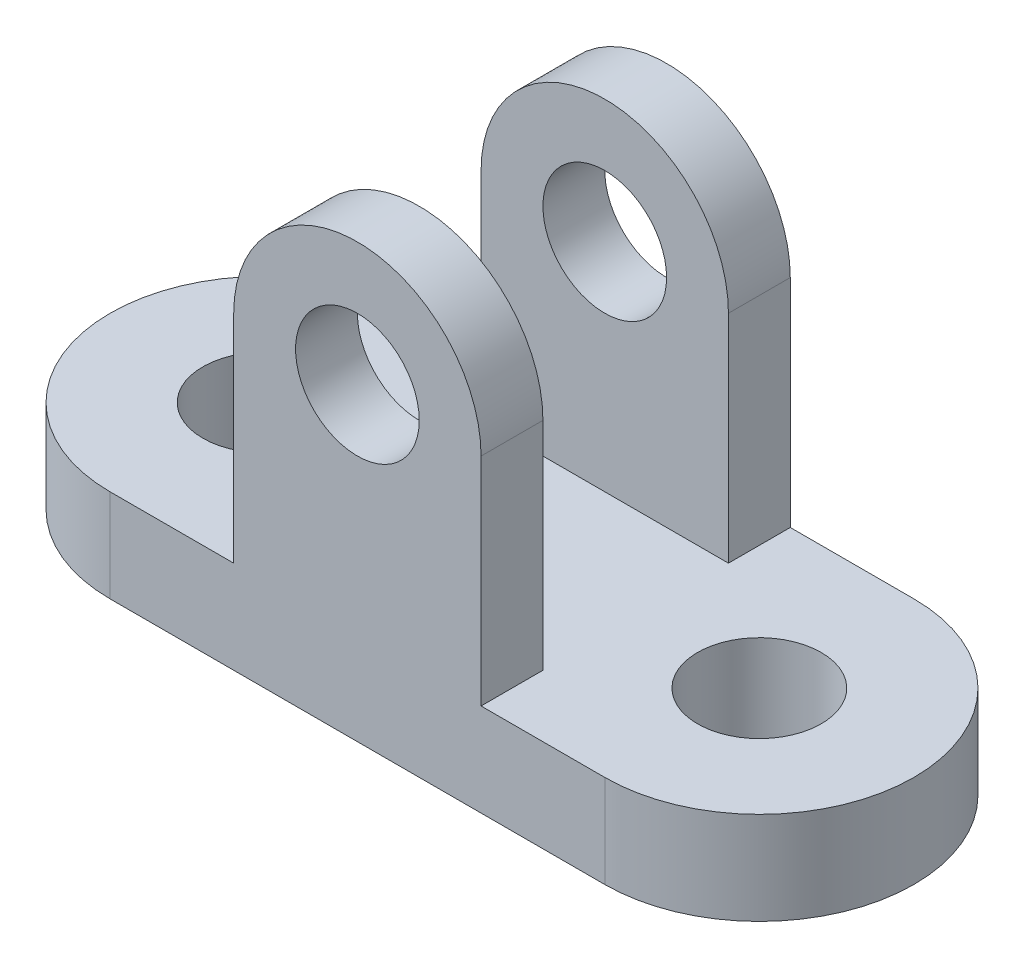
ISO-10303-21;
HEADER;
FILE_DESCRIPTION(('STEP AP214'),'2;1');
FILE_NAME('part.step','',(''),(''),'','','');
FILE_SCHEMA(('AUTOMOTIVE_DESIGN { 1 0 10303 214 1 1 1 1 }'));
ENDSEC;
DATA;
#1=APPLICATION_CONTEXT('core data for automotive mechanical design processes');
#2=APPLICATION_PROTOCOL_DEFINITION('international standard','automotive_design',2000,#1);
#3=PRODUCT_CONTEXT('',#1,'mechanical');
#4=PRODUCT('Part','Part','',(#3));
#5=PRODUCT_RELATED_PRODUCT_CATEGORY('part','',(#4));
#6=PRODUCT_DEFINITION_FORMATION('','',#4);
#7=PRODUCT_DEFINITION_CONTEXT('part definition',#1,'design');
#8=PRODUCT_DEFINITION('design','',#6,#7);
#9=PRODUCT_DEFINITION_SHAPE('','',#8);
#10=(LENGTH_UNIT() NAMED_UNIT(*) SI_UNIT(.MILLI.,.METRE.));
#11=(NAMED_UNIT(*) PLANE_ANGLE_UNIT() SI_UNIT($,.RADIAN.));
#12=(NAMED_UNIT(*) SI_UNIT($,.STERADIAN.) SOLID_ANGLE_UNIT());
#13=UNCERTAINTY_MEASURE_WITH_UNIT(LENGTH_MEASURE(1.E-05),#10,'distance_accuracy_value','');
#14=(GEOMETRIC_REPRESENTATION_CONTEXT(3) GLOBAL_UNCERTAINTY_ASSIGNED_CONTEXT((#13)) GLOBAL_UNIT_ASSIGNED_CONTEXT((#10,
#11,#12)) REPRESENTATION_CONTEXT('',''));
#15=CARTESIAN_POINT('',(0.,0.,0.));
#16=DIRECTION('',(0.,0.,1.));
#17=DIRECTION('',(1.,0.,0.));
#18=AXIS2_PLACEMENT_3D('',#15,#16,#17);
#19=CARTESIAN_POINT('',(-20.,0.,-105.622577482986));
#20=DIRECTION('',(-1.,0.,0.));
#21=DIRECTION('',(0.,0.,1.));
#22=AXIS2_PLACEMENT_3D('',#19,#20,#21);
#23=PLANE('',#22);
#24=DIRECTION('',(0.,0.,1.));
#25=VECTOR('',#24,1.);
#26=CARTESIAN_POINT('',(-20.,15.,0.));
#27=LINE('',#26,#25);
#28=CARTESIAN_POINT('',(-20.,15.,-25.));
#29=VERTEX_POINT('',#28);
#30=CARTESIAN_POINT('',(-20.,15.,-15.));
#31=VERTEX_POINT('',#30);
#32=EDGE_CURVE('E162',#29,#31,#27,.T.);
#33=ORIENTED_EDGE('',*,*,#32,.T.);
#34=DIRECTION('',(0.,1.,0.));
#35=VECTOR('',#34,1.);
#36=CARTESIAN_POINT('',(-20.,0.,-15.));
#37=LINE('',#36,#35);
#38=CARTESIAN_POINT('',(-20.,50.,-15.));
#39=VERTEX_POINT('',#38);
#40=EDGE_CURVE('E240',#31,#39,#37,.T.);
#41=ORIENTED_EDGE('',*,*,#40,.T.);
#42=DIRECTION('',(0.,0.,1.));
#43=VECTOR('',#42,1.);
#44=CARTESIAN_POINT('',(-20.,50.,-105.622577482986));
#45=LINE('',#44,#43);
#46=CARTESIAN_POINT('',(-20.,50.,-25.));
#47=VERTEX_POINT('',#46);
#48=EDGE_CURVE('E265',#47,#39,#45,.T.);
#49=ORIENTED_EDGE('',*,*,#48,.F.);
#50=DIRECTION('',(0.,1.,0.));
#51=VECTOR('',#50,1.);
#52=CARTESIAN_POINT('',(-20.,0.,-25.));
#53=LINE('',#52,#51);
#54=EDGE_CURVE('E248',#29,#47,#53,.T.);
#55=ORIENTED_EDGE('',*,*,#54,.F.);
#56=EDGE_LOOP('',(#33,#41,#49,#55));
#57=FACE_BOUND('',#56,.T.);
#58=ADVANCED_FACE('F45',(#57),#23,.T.);
#59=CARTESIAN_POINT('',(-20.,50.,15.));
#60=VERTEX_POINT('',#59);
#61=CARTESIAN_POINT('',(-20.,50.,25.));
#62=VERTEX_POINT('',#61);
#63=EDGE_CURVE('E151',#60,#62,#45,.T.);
#64=ORIENTED_EDGE('',*,*,#63,.F.);
#65=DIRECTION('',(0.,-1.,0.));
#66=VECTOR('',#65,1.);
#67=CARTESIAN_POINT('',(-20.,0.,15.));
#68=LINE('',#67,#66);
#69=CARTESIAN_POINT('',(-20.,15.,15.));
#70=VERTEX_POINT('',#69);
#71=EDGE_CURVE('E137',#60,#70,#68,.T.);
#72=ORIENTED_EDGE('',*,*,#71,.T.);
#73=CARTESIAN_POINT('',(-20.,15.,25.));
#74=VERTEX_POINT('',#73);
#75=EDGE_CURVE('E149',#70,#74,#27,.T.);
#76=ORIENTED_EDGE('',*,*,#75,.T.);
#77=DIRECTION('',(0.,-1.,0.));
#78=VECTOR('',#77,1.);
#79=CARTESIAN_POINT('',(-20.,0.,25.));
#80=LINE('',#79,#78);
#81=EDGE_CURVE('E249',#62,#74,#80,.T.);
#82=ORIENTED_EDGE('',*,*,#81,.F.);
#83=EDGE_LOOP('',(#64,#72,#76,#82));
#84=FACE_BOUND('',#83,.T.);
#85=ADVANCED_FACE('F147',(#84),#23,.T.);
#86=CARTESIAN_POINT('',(0.,50.,-105.622577482986));
#87=DIRECTION('',(0.,0.,1.));
#88=DIRECTION('',(1.,0.,0.));
#89=AXIS2_PLACEMENT_3D('',#86,#87,#88);
#90=CYLINDRICAL_SURFACE('',#89,20.);
#91=CARTESIAN_POINT('',(0.,50.,-15.));
#92=DIRECTION('',(0.,0.,1.));
#93=DIRECTION('',(1.,0.,0.));
#94=AXIS2_PLACEMENT_3D('',#91,#92,#93);
#95=CIRCLE('',#94,20.);
#96=CARTESIAN_POINT('',(20.,50.,-15.));
#97=VERTEX_POINT('',#96);
#98=EDGE_CURVE('E237',#39,#97,#95,.F.);
#99=ORIENTED_EDGE('',*,*,#98,.T.);
#100=DIRECTION('',(0.,0.,1.));
#101=VECTOR('',#100,1.);
#102=CARTESIAN_POINT('',(20.,50.,-105.622577482986));
#103=LINE('',#102,#101);
#104=CARTESIAN_POINT('',(20.,50.,-25.));
#105=VERTEX_POINT('',#104);
#106=EDGE_CURVE('E255',#105,#97,#103,.T.);
#107=ORIENTED_EDGE('',*,*,#106,.F.);
#108=CARTESIAN_POINT('',(0.,50.,-25.));
#109=DIRECTION('',(0.,0.,1.));
#110=DIRECTION('',(1.,0.,0.));
#111=AXIS2_PLACEMENT_3D('',#108,#109,#110);
#112=CIRCLE('',#111,20.);
#113=EDGE_CURVE('E276',#47,#105,#112,.F.);
#114=ORIENTED_EDGE('',*,*,#113,.F.);
#115=ORIENTED_EDGE('',*,*,#48,.T.);
#116=EDGE_LOOP('',(#99,#107,#114,#115));
#117=FACE_BOUND('',#116,.T.);
#118=ADVANCED_FACE('F324',(#117),#90,.T.);
#119=CARTESIAN_POINT('',(20.,50.,15.));
#120=VERTEX_POINT('',#119);
#121=CARTESIAN_POINT('',(20.,50.,25.));
#122=VERTEX_POINT('',#121);
#123=EDGE_CURVE('E273',#120,#122,#103,.T.);
#124=ORIENTED_EDGE('',*,*,#123,.F.);
#125=CARTESIAN_POINT('',(0.,50.,15.));
#126=DIRECTION('',(0.,0.,-1.));
#127=DIRECTION('',(-1.,0.,0.));
#128=AXIS2_PLACEMENT_3D('',#125,#126,#127);
#129=CIRCLE('',#128,20.);
#130=EDGE_CURVE('E153',#120,#60,#129,.F.);
#131=ORIENTED_EDGE('',*,*,#130,.T.);
#132=ORIENTED_EDGE('',*,*,#63,.T.);
#133=CARTESIAN_POINT('',(0.,50.,25.));
#134=DIRECTION('',(0.,0.,1.));
#135=DIRECTION('',(1.,0.,0.));
#136=AXIS2_PLACEMENT_3D('',#133,#134,#135);
#137=CIRCLE('',#136,20.);
#138=EDGE_CURVE('E244',#122,#62,#137,.T.);
#139=ORIENTED_EDGE('',*,*,#138,.F.);
#140=EDGE_LOOP('',(#124,#131,#132,#139));
#141=FACE_BOUND('',#140,.T.);
#142=ADVANCED_FACE('F294',(#141),#90,.T.);
#143=CARTESIAN_POINT('',(20.,0.,-105.622577482986));
#144=DIRECTION('',(-1.,0.,0.));
#145=DIRECTION('',(0.,0.,1.));
#146=AXIS2_PLACEMENT_3D('',#143,#144,#145);
#147=PLANE('',#146);
#148=DIRECTION('',(0.,1.,0.));
#149=VECTOR('',#148,1.);
#150=CARTESIAN_POINT('',(20.,0.,-15.));
#151=LINE('',#150,#149);
#152=CARTESIAN_POINT('',(20.,15.,-15.));
#153=VERTEX_POINT('',#152);
#154=EDGE_CURVE('E233',#153,#97,#151,.T.);
#155=ORIENTED_EDGE('',*,*,#154,.F.);
#156=DIRECTION('',(0.,0.,1.));
#157=VECTOR('',#156,1.);
#158=CARTESIAN_POINT('',(20.,15.,0.));
#159=LINE('',#158,#157);
#160=CARTESIAN_POINT('',(20.,15.,-25.));
#161=VERTEX_POINT('',#160);
#162=EDGE_CURVE('E163',#161,#153,#159,.T.);
#163=ORIENTED_EDGE('',*,*,#162,.F.);
#164=DIRECTION('',(0.,1.,0.));
#165=VECTOR('',#164,1.);
#166=CARTESIAN_POINT('',(20.,0.,-25.));
#167=LINE('',#166,#165);
#168=EDGE_CURVE('E269',#161,#105,#167,.T.);
#169=ORIENTED_EDGE('',*,*,#168,.T.);
#170=ORIENTED_EDGE('',*,*,#106,.T.);
#171=EDGE_LOOP('',(#155,#163,#169,#170));
#172=FACE_BOUND('',#171,.T.);
#173=ADVANCED_FACE('F316',(#172),#147,.F.);
#174=DIRECTION('',(0.,-1.,0.));
#175=VECTOR('',#174,1.);
#176=CARTESIAN_POINT('',(20.,0.,15.));
#177=LINE('',#176,#175);
#178=CARTESIAN_POINT('',(20.,15.,15.));
#179=VERTEX_POINT('',#178);
#180=EDGE_CURVE('E140',#120,#179,#177,.T.);
#181=ORIENTED_EDGE('',*,*,#180,.F.);
#182=ORIENTED_EDGE('',*,*,#123,.T.);
#183=DIRECTION('',(0.,-1.,0.));
#184=VECTOR('',#183,1.);
#185=CARTESIAN_POINT('',(20.,0.,25.));
#186=LINE('',#185,#184);
#187=CARTESIAN_POINT('',(20.,15.,25.));
#188=VERTEX_POINT('',#187);
#189=EDGE_CURVE('E250',#122,#188,#186,.T.);
#190=ORIENTED_EDGE('',*,*,#189,.T.);
#191=EDGE_CURVE('E68',#179,#188,#159,.T.);
#192=ORIENTED_EDGE('',*,*,#191,.F.);
#193=EDGE_LOOP('',(#181,#182,#190,#192));
#194=FACE_BOUND('',#193,.T.);
#195=ADVANCED_FACE('F287',(#194),#147,.F.);
#196=CARTESIAN_POINT('',(0.,50.,-105.622577482986));
#197=DIRECTION('',(0.,0.,1.));
#198=DIRECTION('',(1.,0.,0.));
#199=AXIS2_PLACEMENT_3D('',#196,#197,#198);
#200=CYLINDRICAL_SURFACE('',#199,10.);
#201=CARTESIAN_POINT('',(0.,50.,-25.));
#202=DIRECTION('',(0.,0.,1.));
#203=DIRECTION('',(1.,0.,0.));
#204=AXIS2_PLACEMENT_3D('',#201,#202,#203);
#205=CIRCLE('',#204,10.);
#206=CARTESIAN_POINT('',(10.,50.,-25.));
#207=VERTEX_POINT('',#206);
#208=EDGE_CURVE('E254',#207,#207,#205,.F.);
#209=ORIENTED_EDGE('',*,*,#208,.T.);
#210=EDGE_LOOP('',(#209));
#211=FACE_BOUND('',#210,.T.);
#212=CARTESIAN_POINT('',(0.,50.,-15.));
#213=DIRECTION('',(0.,0.,1.));
#214=DIRECTION('',(1.,0.,0.));
#215=AXIS2_PLACEMENT_3D('',#212,#213,#214);
#216=CIRCLE('',#215,10.);
#217=CARTESIAN_POINT('',(10.,50.,-15.));
#218=VERTEX_POINT('',#217);
#219=EDGE_CURVE('E49',#218,#218,#216,.F.);
#220=ORIENTED_EDGE('',*,*,#219,.F.);
#221=EDGE_LOOP('',(#220));
#222=FACE_BOUND('',#221,.T.);
#223=ADVANCED_FACE('F377',(#211,#222),#200,.F.);
#224=CARTESIAN_POINT('',(0.,50.,25.));
#225=DIRECTION('',(0.,0.,1.));
#226=DIRECTION('',(1.,0.,0.));
#227=AXIS2_PLACEMENT_3D('',#224,#225,#226);
#228=CIRCLE('',#227,10.);
#229=CARTESIAN_POINT('',(10.,50.,25.));
#230=VERTEX_POINT('',#229);
#231=EDGE_CURVE('E258',#230,#230,#228,.T.);
#232=ORIENTED_EDGE('',*,*,#231,.T.);
#233=EDGE_LOOP('',(#232));
#234=FACE_BOUND('',#233,.T.);
#235=CARTESIAN_POINT('',(0.,50.,15.));
#236=DIRECTION('',(0.,0.,-1.));
#237=DIRECTION('',(-1.,0.,0.));
#238=AXIS2_PLACEMENT_3D('',#235,#236,#237);
#239=CIRCLE('',#238,10.);
#240=CARTESIAN_POINT('',(-10.,50.,15.));
#241=VERTEX_POINT('',#240);
#242=EDGE_CURVE('E142',#241,#241,#239,.F.);
#243=ORIENTED_EDGE('',*,*,#242,.F.);
#244=EDGE_LOOP('',(#243));
#245=FACE_BOUND('',#244,.T.);
#246=ADVANCED_FACE('F348',(#234,#245),#200,.F.);
#247=CARTESIAN_POINT('',(-40.,15.,0.));
#248=DIRECTION('',(0.,1.,0.));
#249=DIRECTION('',(0.,0.,1.));
#250=AXIS2_PLACEMENT_3D('',#247,#248,#249);
#251=PLANE('',#250);
#252=DIRECTION('',(-1.,0.,0.));
#253=VECTOR('',#252,1.);
#254=CARTESIAN_POINT('',(-29.0396991118522,15.,-15.));
#255=LINE('',#254,#253);
#256=EDGE_CURVE('E143',#153,#31,#255,.T.);
#257=ORIENTED_EDGE('',*,*,#256,.T.);
#258=ORIENTED_EDGE('',*,*,#32,.F.);
#259=DIRECTION('',(-1.,0.,0.));
#260=VECTOR('',#259,1.);
#261=CARTESIAN_POINT('',(-40.,15.,-25.));
#262=LINE('',#261,#260);
#263=CARTESIAN_POINT('',(-40.,15.,-25.));
#264=VERTEX_POINT('',#263);
#265=EDGE_CURVE('E199',#29,#264,#262,.T.);
#266=ORIENTED_EDGE('',*,*,#265,.T.);
#267=CARTESIAN_POINT('',(-40.,15.,0.));
#268=DIRECTION('',(0.,1.,0.));
#269=DIRECTION('',(0.,0.,1.));
#270=AXIS2_PLACEMENT_3D('',#267,#268,#269);
#271=CIRCLE('',#270,25.);
#272=CARTESIAN_POINT('',(-40.,15.,25.));
#273=VERTEX_POINT('',#272);
#274=EDGE_CURVE('E189',#264,#273,#271,.T.);
#275=ORIENTED_EDGE('',*,*,#274,.T.);
#276=DIRECTION('',(1.,0.,0.));
#277=VECTOR('',#276,1.);
#278=CARTESIAN_POINT('',(-40.,15.,25.));
#279=LINE('',#278,#277);
#280=EDGE_CURVE('E159',#273,#74,#279,.T.);
#281=ORIENTED_EDGE('',*,*,#280,.T.);
#282=ORIENTED_EDGE('',*,*,#75,.F.);
#283=DIRECTION('',(1.,0.,0.));
#284=VECTOR('',#283,1.);
#285=CARTESIAN_POINT('',(-29.0396991118522,15.,15.));
#286=LINE('',#285,#284);
#287=EDGE_CURVE('E63',#70,#179,#286,.T.);
#288=ORIENTED_EDGE('',*,*,#287,.T.);
#289=ORIENTED_EDGE('',*,*,#191,.T.);
#290=CARTESIAN_POINT('',(40.,15.,25.));
#291=VERTEX_POINT('',#290);
#292=EDGE_CURVE('E192',#188,#291,#279,.T.);
#293=ORIENTED_EDGE('',*,*,#292,.T.);
#294=CARTESIAN_POINT('',(40.,15.,0.));
#295=DIRECTION('',(0.,1.,0.));
#296=DIRECTION('',(0.,0.,1.));
#297=AXIS2_PLACEMENT_3D('',#294,#295,#296);
#298=CIRCLE('',#297,25.);
#299=CARTESIAN_POINT('',(40.,15.,-25.));
#300=VERTEX_POINT('',#299);
#301=EDGE_CURVE('E196',#291,#300,#298,.T.);
#302=ORIENTED_EDGE('',*,*,#301,.T.);
#303=EDGE_CURVE('E200',#300,#161,#262,.T.);
#304=ORIENTED_EDGE('',*,*,#303,.T.);
#305=ORIENTED_EDGE('',*,*,#162,.T.);
#306=EDGE_LOOP('',(#257,#258,#266,#275,#281,#282,#288,#289,#293,#302,#304,#305));
#307=FACE_BOUND('',#306,.T.);
#308=CARTESIAN_POINT('',(-40.,15.,0.));
#309=DIRECTION('',(0.,1.,0.));
#310=DIRECTION('',(0.,0.,1.));
#311=AXIS2_PLACEMENT_3D('',#308,#309,#310);
#312=CIRCLE('',#311,10.);
#313=CARTESIAN_POINT('',(-40.,15.,10.));
#314=VERTEX_POINT('',#313);
#315=EDGE_CURVE('E181',#314,#314,#312,.T.);
#316=ORIENTED_EDGE('',*,*,#315,.F.);
#317=EDGE_LOOP('',(#316));
#318=FACE_BOUND('',#317,.T.);
#319=CARTESIAN_POINT('',(40.,15.,0.));
#320=DIRECTION('',(0.,1.,0.));
#321=DIRECTION('',(0.,0.,-1.));
#322=AXIS2_PLACEMENT_3D('',#319,#320,#321);
#323=CIRCLE('',#322,10.);
#324=CARTESIAN_POINT('',(40.,15.,-10.));
#325=VERTEX_POINT('',#324);
#326=EDGE_CURVE('E173',#325,#325,#323,.T.);
#327=ORIENTED_EDGE('',*,*,#326,.F.);
#328=EDGE_LOOP('',(#327));
#329=FACE_BOUND('',#328,.T.);
#330=ADVANCED_FACE('F156',(#307,#318,#329),#251,.T.);
#331=CARTESIAN_POINT('',(-40.,0.,0.));
#332=DIRECTION('',(0.,1.,0.));
#333=DIRECTION('',(0.,0.,1.));
#334=AXIS2_PLACEMENT_3D('',#331,#332,#333);
#335=PLANE('',#334);
#336=CARTESIAN_POINT('',(-40.,0.,0.));
#337=DIRECTION('',(0.,1.,0.));
#338=DIRECTION('',(0.,0.,1.));
#339=AXIS2_PLACEMENT_3D('',#336,#337,#338);
#340=CIRCLE('',#339,25.);
#341=CARTESIAN_POINT('',(-40.,0.,-25.));
#342=VERTEX_POINT('',#341);
#343=CARTESIAN_POINT('',(-40.,0.,25.));
#344=VERTEX_POINT('',#343);
#345=EDGE_CURVE('E185',#342,#344,#340,.T.);
#346=ORIENTED_EDGE('',*,*,#345,.F.);
#347=DIRECTION('',(-1.,0.,0.));
#348=VECTOR('',#347,1.);
#349=CARTESIAN_POINT('',(-40.,0.,-25.));
#350=LINE('',#349,#348);
#351=CARTESIAN_POINT('',(40.,0.,-25.));
#352=VERTEX_POINT('',#351);
#353=EDGE_CURVE('E193',#352,#342,#350,.T.);
#354=ORIENTED_EDGE('',*,*,#353,.F.);
#355=CARTESIAN_POINT('',(40.,0.,0.));
#356=DIRECTION('',(0.,1.,0.));
#357=DIRECTION('',(0.,0.,1.));
#358=AXIS2_PLACEMENT_3D('',#355,#356,#357);
#359=CIRCLE('',#358,25.);
#360=CARTESIAN_POINT('',(40.,0.,25.));
#361=VERTEX_POINT('',#360);
#362=EDGE_CURVE('E210',#361,#352,#359,.T.);
#363=ORIENTED_EDGE('',*,*,#362,.F.);
#364=DIRECTION('',(1.,0.,0.));
#365=VECTOR('',#364,1.);
#366=CARTESIAN_POINT('',(-40.,0.,25.));
#367=LINE('',#366,#365);
#368=EDGE_CURVE('E207',#344,#361,#367,.T.);
#369=ORIENTED_EDGE('',*,*,#368,.F.);
#370=EDGE_LOOP('',(#346,#354,#363,#369));
#371=FACE_BOUND('',#370,.T.);
#372=CARTESIAN_POINT('',(-40.,0.,0.));
#373=DIRECTION('',(0.,1.,0.));
#374=DIRECTION('',(0.,0.,1.));
#375=AXIS2_PLACEMENT_3D('',#372,#373,#374);
#376=CIRCLE('',#375,10.);
#377=CARTESIAN_POINT('',(-40.,0.,10.));
#378=VERTEX_POINT('',#377);
#379=EDGE_CURVE('E177',#378,#378,#376,.T.);
#380=ORIENTED_EDGE('',*,*,#379,.T.);
#381=EDGE_LOOP('',(#380));
#382=FACE_BOUND('',#381,.T.);
#383=CARTESIAN_POINT('',(40.,0.,0.));
#384=DIRECTION('',(0.,1.,0.));
#385=DIRECTION('',(0.,0.,-1.));
#386=AXIS2_PLACEMENT_3D('',#383,#384,#385);
#387=CIRCLE('',#386,10.);
#388=CARTESIAN_POINT('',(40.,0.,-10.));
#389=VERTEX_POINT('',#388);
#390=EDGE_CURVE('E168',#389,#389,#387,.T.);
#391=ORIENTED_EDGE('',*,*,#390,.T.);
#392=EDGE_LOOP('',(#391));
#393=FACE_BOUND('',#392,.T.);
#394=ADVANCED_FACE('F304',(#371,#382,#393),#335,.F.);
#395=CARTESIAN_POINT('',(-40.,15.,0.));
#396=DIRECTION('',(0.,-1.,0.));
#397=DIRECTION('',(0.,0.,-1.));
#398=AXIS2_PLACEMENT_3D('',#395,#396,#397);
#399=CYLINDRICAL_SURFACE('',#398,25.);
#400=ORIENTED_EDGE('',*,*,#345,.T.);
#401=DIRECTION('',(0.,-1.,0.));
#402=VECTOR('',#401,1.);
#403=CARTESIAN_POINT('',(-40.,15.,25.));
#404=LINE('',#403,#402);
#405=EDGE_CURVE('E11',#273,#344,#404,.T.);
#406=ORIENTED_EDGE('',*,*,#405,.F.);
#407=ORIENTED_EDGE('',*,*,#274,.F.);
#408=DIRECTION('',(0.,-1.,0.));
#409=VECTOR('',#408,1.);
#410=CARTESIAN_POINT('',(-40.,15.,-25.));
#411=LINE('',#410,#409);
#412=EDGE_CURVE('E203',#264,#342,#411,.T.);
#413=ORIENTED_EDGE('',*,*,#412,.T.);
#414=EDGE_LOOP('',(#400,#406,#407,#413));
#415=FACE_BOUND('',#414,.T.);
#416=ADVANCED_FACE('F47',(#415),#399,.T.);
#417=CARTESIAN_POINT('',(-40.,15.,25.));
#418=DIRECTION('',(0.,0.,-1.));
#419=DIRECTION('',(-1.,0.,0.));
#420=AXIS2_PLACEMENT_3D('',#417,#418,#419);
#421=PLANE('',#420);
#422=ORIENTED_EDGE('',*,*,#368,.T.);
#423=DIRECTION('',(0.,-1.,0.));
#424=VECTOR('',#423,1.);
#425=CARTESIAN_POINT('',(40.,15.,25.));
#426=LINE('',#425,#424);
#427=EDGE_CURVE('E55',#291,#361,#426,.T.);
#428=ORIENTED_EDGE('',*,*,#427,.F.);
#429=ORIENTED_EDGE('',*,*,#292,.F.);
#430=ORIENTED_EDGE('',*,*,#189,.F.);
#431=ORIENTED_EDGE('',*,*,#138,.T.);
#432=ORIENTED_EDGE('',*,*,#81,.T.);
#433=ORIENTED_EDGE('',*,*,#280,.F.);
#434=ORIENTED_EDGE('',*,*,#405,.T.);
#435=EDGE_LOOP('',(#422,#428,#429,#430,#431,#432,#433,#434));
#436=FACE_BOUND('',#435,.T.);
#437=ORIENTED_EDGE('',*,*,#231,.F.);
#438=EDGE_LOOP('',(#437));
#439=FACE_BOUND('',#438,.T.);
#440=ADVANCED_FACE('F291',(#436,#439),#421,.F.);
#441=CARTESIAN_POINT('',(40.,15.,0.));
#442=DIRECTION('',(0.,-1.,0.));
#443=DIRECTION('',(0.,0.,-1.));
#444=AXIS2_PLACEMENT_3D('',#441,#442,#443);
#445=CYLINDRICAL_SURFACE('',#444,25.);
#446=ORIENTED_EDGE('',*,*,#362,.T.);
#447=DIRECTION('',(0.,-1.,0.));
#448=VECTOR('',#447,1.);
#449=CARTESIAN_POINT('',(40.,15.,-25.));
#450=LINE('',#449,#448);
#451=EDGE_CURVE('E218',#300,#352,#450,.T.);
#452=ORIENTED_EDGE('',*,*,#451,.F.);
#453=ORIENTED_EDGE('',*,*,#301,.F.);
#454=ORIENTED_EDGE('',*,*,#427,.T.);
#455=EDGE_LOOP('',(#446,#452,#453,#454));
#456=FACE_BOUND('',#455,.T.);
#457=ADVANCED_FACE('F309',(#456),#445,.T.);
#458=CARTESIAN_POINT('',(-40.,15.,-25.));
#459=DIRECTION('',(0.,0.,1.));
#460=DIRECTION('',(1.,0.,0.));
#461=AXIS2_PLACEMENT_3D('',#458,#459,#460);
#462=PLANE('',#461);
#463=ORIENTED_EDGE('',*,*,#265,.F.);
#464=ORIENTED_EDGE('',*,*,#54,.T.);
#465=ORIENTED_EDGE('',*,*,#113,.T.);
#466=ORIENTED_EDGE('',*,*,#168,.F.);
#467=ORIENTED_EDGE('',*,*,#303,.F.);
#468=ORIENTED_EDGE('',*,*,#451,.T.);
#469=ORIENTED_EDGE('',*,*,#353,.T.);
#470=ORIENTED_EDGE('',*,*,#412,.F.);
#471=EDGE_LOOP('',(#463,#464,#465,#466,#467,#468,#469,#470));
#472=FACE_BOUND('',#471,.T.);
#473=ORIENTED_EDGE('',*,*,#208,.F.);
#474=EDGE_LOOP('',(#473));
#475=FACE_BOUND('',#474,.T.);
#476=ADVANCED_FACE('F317',(#472,#475),#462,.F.);
#477=CARTESIAN_POINT('',(-40.,15.,0.));
#478=DIRECTION('',(0.,-1.,0.));
#479=DIRECTION('',(0.,0.,-1.));
#480=AXIS2_PLACEMENT_3D('',#477,#478,#479);
#481=CYLINDRICAL_SURFACE('',#480,10.);
#482=ORIENTED_EDGE('',*,*,#315,.T.);
#483=EDGE_LOOP('',(#482));
#484=FACE_BOUND('',#483,.T.);
#485=ORIENTED_EDGE('',*,*,#379,.F.);
#486=EDGE_LOOP('',(#485));
#487=FACE_BOUND('',#486,.T.);
#488=ADVANCED_FACE('F341',(#484,#487),#481,.F.);
#489=CARTESIAN_POINT('',(40.,15.,0.));
#490=DIRECTION('',(0.,-1.,0.));
#491=DIRECTION('',(0.,0.,-1.));
#492=AXIS2_PLACEMENT_3D('',#489,#490,#491);
#493=CYLINDRICAL_SURFACE('',#492,10.);
#494=ORIENTED_EDGE('',*,*,#326,.T.);
#495=EDGE_LOOP('',(#494));
#496=FACE_BOUND('',#495,.T.);
#497=ORIENTED_EDGE('',*,*,#390,.F.);
#498=EDGE_LOOP('',(#497));
#499=FACE_BOUND('',#498,.T.);
#500=ADVANCED_FACE('F338',(#496,#499),#493,.F.);
#501=CARTESIAN_POINT('',(-29.0396991118522,70.,-15.));
#502=DIRECTION('',(0.,0.,1.));
#503=DIRECTION('',(1.,0.,0.));
#504=AXIS2_PLACEMENT_3D('',#501,#502,#503);
#505=PLANE('',#504);
#506=ORIENTED_EDGE('',*,*,#256,.F.);
#507=ORIENTED_EDGE('',*,*,#154,.T.);
#508=ORIENTED_EDGE('',*,*,#98,.F.);
#509=ORIENTED_EDGE('',*,*,#40,.F.);
#510=EDGE_LOOP('',(#506,#507,#508,#509));
#511=FACE_BOUND('',#510,.T.);
#512=ORIENTED_EDGE('',*,*,#219,.T.);
#513=EDGE_LOOP('',(#512));
#514=FACE_BOUND('',#513,.T.);
#515=ADVANCED_FACE('F326',(#511,#514),#505,.T.);
#516=CARTESIAN_POINT('',(-29.0396991118522,70.,15.));
#517=DIRECTION('',(0.,0.,-1.));
#518=DIRECTION('',(-1.,0.,0.));
#519=AXIS2_PLACEMENT_3D('',#516,#517,#518);
#520=PLANE('',#519);
#521=ORIENTED_EDGE('',*,*,#130,.F.);
#522=ORIENTED_EDGE('',*,*,#180,.T.);
#523=ORIENTED_EDGE('',*,*,#287,.F.);
#524=ORIENTED_EDGE('',*,*,#71,.F.);
#525=EDGE_LOOP('',(#521,#522,#523,#524));
#526=FACE_BOUND('',#525,.T.);
#527=ORIENTED_EDGE('',*,*,#242,.T.);
#528=EDGE_LOOP('',(#527));
#529=FACE_BOUND('',#528,.T.);
#530=ADVANCED_FACE('F135',(#526,#529),#520,.T.);
#531=CLOSED_SHELL('',(#58,#85,#118,#142,#173,#195,#223,#246,#330,#394,#416,#440,#457,#476,#488,
#500,#515,#530));
#532=MANIFOLD_SOLID_BREP('B2',#531);
#533=ADVANCED_BREP_SHAPE_REPRESENTATION('',(#18,#532),#14);
#534=SHAPE_DEFINITION_REPRESENTATION(#9,#533);
ENDSEC;
END-ISO-10303-21;
